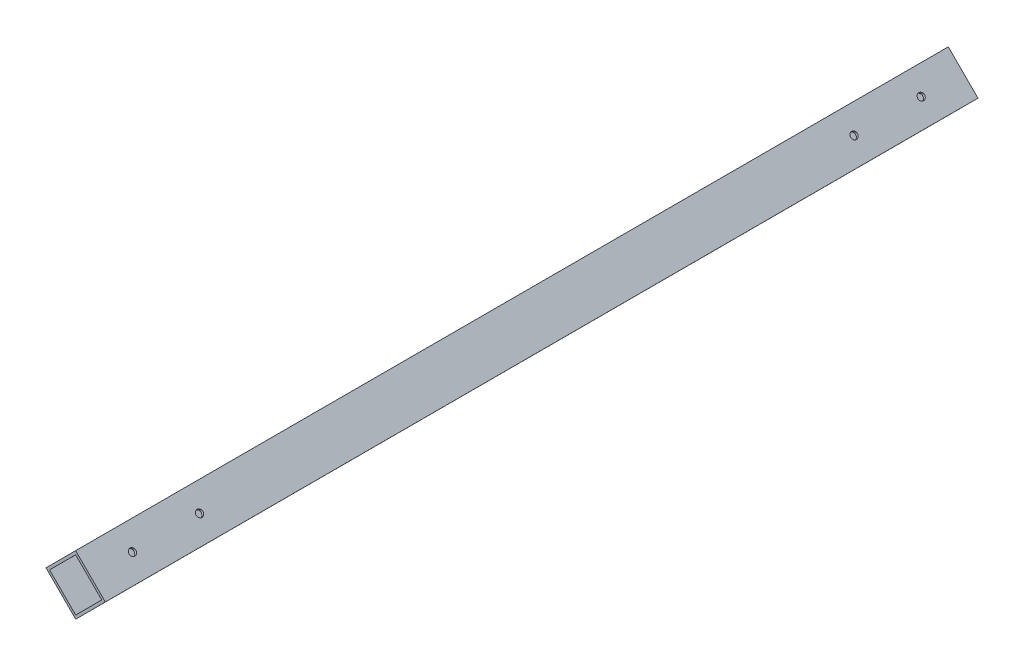
ISO-10303-21;
HEADER;
FILE_DESCRIPTION(('STEP AP214'),'2;1');
FILE_NAME('part.step','',(''),(''),'','','');
FILE_SCHEMA(('AUTOMOTIVE_DESIGN { 1 0 10303 214 1 1 1 1 }'));
ENDSEC;
DATA;
#1=APPLICATION_CONTEXT('core data for automotive mechanical design processes');
#2=APPLICATION_PROTOCOL_DEFINITION('international standard','automotive_design',2000,#1);
#3=PRODUCT_CONTEXT('',#1,'mechanical');
#4=PRODUCT('Part','Part','',(#3));
#5=PRODUCT_RELATED_PRODUCT_CATEGORY('part','',(#4));
#6=PRODUCT_DEFINITION_FORMATION('','',#4);
#7=PRODUCT_DEFINITION_CONTEXT('part definition',#1,'design');
#8=PRODUCT_DEFINITION('design','',#6,#7);
#9=PRODUCT_DEFINITION_SHAPE('','',#8);
#10=(LENGTH_UNIT() NAMED_UNIT(*) SI_UNIT(.MILLI.,.METRE.));
#11=(NAMED_UNIT(*) PLANE_ANGLE_UNIT() SI_UNIT($,.RADIAN.));
#12=(NAMED_UNIT(*) SI_UNIT($,.STERADIAN.) SOLID_ANGLE_UNIT());
#13=UNCERTAINTY_MEASURE_WITH_UNIT(LENGTH_MEASURE(1.E-05),#10,'distance_accuracy_value','');
#14=(GEOMETRIC_REPRESENTATION_CONTEXT(3) GLOBAL_UNCERTAINTY_ASSIGNED_CONTEXT((#13)) GLOBAL_UNIT_ASSIGNED_CONTEXT((#10,
#11,#12)) REPRESENTATION_CONTEXT('',''));
#15=CARTESIAN_POINT('',(0.,0.,0.));
#16=DIRECTION('',(0.,0.,1.));
#17=DIRECTION('',(1.,0.,0.));
#18=AXIS2_PLACEMENT_3D('',#15,#16,#17);
#19=CARTESIAN_POINT('',(0.,0.,520.));
#20=DIRECTION('',(0.,0.,1.));
#21=DIRECTION('',(1.,0.,0.));
#22=AXIS2_PLACEMENT_3D('',#19,#20,#21);
#23=PLANE('',#22);
#24=DIRECTION('',(-0.70646122875546,-0.707751744798503,0.));
#25=VECTOR('',#24,1.);
#26=CARTESIAN_POINT('',(0.,0.,520.));
#27=LINE('',#26,#25);
#28=CARTESIAN_POINT('',(0.,0.,520.));
#29=VERTEX_POINT('',#28);
#30=CARTESIAN_POINT('',(-17.6615307188865,-17.6937936199626,520.));
#31=VERTEX_POINT('',#30);
#32=EDGE_CURVE('E143',#29,#31,#27,.T.);
#33=ORIENTED_EDGE('',*,*,#32,.T.);
#34=DIRECTION('',(0.707751744798503,-0.70646122875546,0.));
#35=VECTOR('',#34,1.);
#36=CARTESIAN_POINT('',(-17.6615307188865,-17.6937936199626,520.));
#37=LINE('',#36,#35);
#38=CARTESIAN_POINT('',(0.0322629010760627,-35.3553243388491,520.));
#39=VERTEX_POINT('',#38);
#40=EDGE_CURVE('E146',#31,#39,#37,.T.);
#41=ORIENTED_EDGE('',*,*,#40,.T.);
#42=DIRECTION('',(0.70646122875546,0.707751744798503,0.));
#43=VECTOR('',#42,1.);
#44=CARTESIAN_POINT('',(17.6937936199626,-17.6615307188865,520.));
#45=LINE('',#44,#43);
#46=CARTESIAN_POINT('',(17.6937936199626,-17.6615307188865,520.));
#47=VERTEX_POINT('',#46);
#48=EDGE_CURVE('E149',#39,#47,#45,.T.);
#49=ORIENTED_EDGE('',*,*,#48,.T.);
#50=DIRECTION('',(-0.707751744798503,0.70646122875546,0.));
#51=VECTOR('',#50,1.);
#52=CARTESIAN_POINT('',(0.,0.,520.));
#53=LINE('',#52,#51);
#54=EDGE_CURVE('E151',#47,#29,#53,.T.);
#55=ORIENTED_EDGE('',*,*,#54,.T.);
#56=EDGE_LOOP('',(#33,#41,#49,#55));
#57=FACE_BOUND('',#56,.T.);
#58=DIRECTION('',(-0.706461228755461,-0.707751744798503,0.));
#59=VECTOR('',#58,1.);
#60=CARTESIAN_POINT('',(0.00193577406456353,-2.12131946033095,520.));
#61=LINE('',#60,#59);
#62=CARTESIAN_POINT('',(0.00193577406456353,-2.12131946033095,520.));
#63=VERTEX_POINT('',#62);
#64=CARTESIAN_POINT('',(-15.5402112585556,-17.691857845898,520.));
#65=VERTEX_POINT('',#64);
#66=EDGE_CURVE('E113',#63,#65,#61,.T.);
#67=ORIENTED_EDGE('',*,*,#66,.F.);
#68=DIRECTION('',(-0.707751744798503,0.70646122875546,0.));
#69=VECTOR('',#68,1.);
#70=CARTESIAN_POINT('',(0.00193577406456353,-2.12131946033095,520.));
#71=LINE('',#70,#69);
#72=CARTESIAN_POINT('',(15.5724741596316,-17.6634664929511,520.));
#73=VERTEX_POINT('',#72);
#74=EDGE_CURVE('E105',#73,#63,#71,.T.);
#75=ORIENTED_EDGE('',*,*,#74,.F.);
#76=DIRECTION('',(0.70646122875546,0.707751744798503,0.));
#77=VECTOR('',#76,1.);
#78=CARTESIAN_POINT('',(15.5724741596316,-17.6634664929511,520.));
#79=LINE('',#78,#77);
#80=CARTESIAN_POINT('',(0.0303271270114952,-33.2340048785181,520.));
#81=VERTEX_POINT('',#80);
#82=EDGE_CURVE('E127',#81,#73,#79,.T.);
#83=ORIENTED_EDGE('',*,*,#82,.F.);
#84=DIRECTION('',(0.707751744798503,-0.70646122875546,0.));
#85=VECTOR('',#84,1.);
#86=CARTESIAN_POINT('',(-15.5402112585556,-17.691857845898,520.));
#87=LINE('',#86,#85);
#88=EDGE_CURVE('E125',#65,#81,#87,.T.);
#89=ORIENTED_EDGE('',*,*,#88,.F.);
#90=EDGE_LOOP('',(#67,#75,#83,#89));
#91=FACE_BOUND('',#90,.T.);
#92=ADVANCED_FACE('F38',(#57,#91),#23,.T.);
#93=CARTESIAN_POINT('',(0.,0.,0.));
#94=DIRECTION('',(0.,0.,1.));
#95=DIRECTION('',(1.,0.,0.));
#96=AXIS2_PLACEMENT_3D('',#93,#94,#95);
#97=PLANE('',#96);
#98=DIRECTION('',(-0.70646122875546,-0.707751744798503,0.));
#99=VECTOR('',#98,1.);
#100=CARTESIAN_POINT('',(0.,0.,0.));
#101=LINE('',#100,#99);
#102=CARTESIAN_POINT('',(0.,0.,0.));
#103=VERTEX_POINT('',#102);
#104=CARTESIAN_POINT('',(-17.6615307188865,-17.6937936199626,0.));
#105=VERTEX_POINT('',#104);
#106=EDGE_CURVE('E121',#103,#105,#101,.T.);
#107=ORIENTED_EDGE('',*,*,#106,.F.);
#108=DIRECTION('',(-0.707751744798503,0.70646122875546,0.));
#109=VECTOR('',#108,1.);
#110=CARTESIAN_POINT('',(0.,0.,0.));
#111=LINE('',#110,#109);
#112=CARTESIAN_POINT('',(17.6937936199626,-17.6615307188865,0.));
#113=VERTEX_POINT('',#112);
#114=EDGE_CURVE('E147',#113,#103,#111,.T.);
#115=ORIENTED_EDGE('',*,*,#114,.F.);
#116=DIRECTION('',(0.70646122875546,0.707751744798503,0.));
#117=VECTOR('',#116,1.);
#118=CARTESIAN_POINT('',(17.6937936199626,-17.6615307188865,0.));
#119=LINE('',#118,#117);
#120=CARTESIAN_POINT('',(0.0322629010760627,-35.3553243388491,0.));
#121=VERTEX_POINT('',#120);
#122=EDGE_CURVE('E158',#121,#113,#119,.T.);
#123=ORIENTED_EDGE('',*,*,#122,.F.);
#124=DIRECTION('',(0.707751744798503,-0.70646122875546,0.));
#125=VECTOR('',#124,1.);
#126=CARTESIAN_POINT('',(-17.6615307188865,-17.6937936199626,0.));
#127=LINE('',#126,#125);
#128=EDGE_CURVE('E156',#105,#121,#127,.T.);
#129=ORIENTED_EDGE('',*,*,#128,.F.);
#130=EDGE_LOOP('',(#107,#115,#123,#129));
#131=FACE_BOUND('',#130,.T.);
#132=DIRECTION('',(-0.707751744798503,0.70646122875546,0.));
#133=VECTOR('',#132,1.);
#134=CARTESIAN_POINT('',(0.00193577406456353,-2.12131946033095,0.));
#135=LINE('',#134,#133);
#136=CARTESIAN_POINT('',(15.5724741596316,-17.6634664929511,0.));
#137=VERTEX_POINT('',#136);
#138=CARTESIAN_POINT('',(0.00193577406456353,-2.12131946033095,0.));
#139=VERTEX_POINT('',#138);
#140=EDGE_CURVE('E63',#137,#139,#135,.T.);
#141=ORIENTED_EDGE('',*,*,#140,.T.);
#142=DIRECTION('',(-0.706461228755461,-0.707751744798503,0.));
#143=VECTOR('',#142,1.);
#144=CARTESIAN_POINT('',(0.00193577406456353,-2.12131946033095,0.));
#145=LINE('',#144,#143);
#146=CARTESIAN_POINT('',(-15.5402112585556,-17.691857845898,0.));
#147=VERTEX_POINT('',#146);
#148=EDGE_CURVE('E120',#139,#147,#145,.T.);
#149=ORIENTED_EDGE('',*,*,#148,.T.);
#150=DIRECTION('',(0.707751744798503,-0.70646122875546,0.));
#151=VECTOR('',#150,1.);
#152=CARTESIAN_POINT('',(-15.5402112585556,-17.691857845898,0.));
#153=LINE('',#152,#151);
#154=CARTESIAN_POINT('',(0.0303271270114987,-33.2340048785181,0.));
#155=VERTEX_POINT('',#154);
#156=EDGE_CURVE('E135',#147,#155,#153,.T.);
#157=ORIENTED_EDGE('',*,*,#156,.T.);
#158=DIRECTION('',(0.70646122875546,0.707751744798503,0.));
#159=VECTOR('',#158,1.);
#160=CARTESIAN_POINT('',(15.5724741596316,-17.6634664929511,0.));
#161=LINE('',#160,#159);
#162=EDGE_CURVE('E114',#155,#137,#161,.T.);
#163=ORIENTED_EDGE('',*,*,#162,.T.);
#164=EDGE_LOOP('',(#141,#149,#157,#163));
#165=FACE_BOUND('',#164,.T.);
#166=ADVANCED_FACE('F227',(#131,#165),#97,.F.);
#167=CARTESIAN_POINT('',(0.,0.,520.));
#168=DIRECTION('',(0.707751744798503,-0.70646122875546,0.));
#169=DIRECTION('',(0.70646122875546,0.707751744798503,0.));
#170=AXIS2_PLACEMENT_3D('',#167,#168,#169);
#171=PLANE('',#170);
#172=ORIENTED_EDGE('',*,*,#106,.T.);
#173=DIRECTION('',(0.,0.,-1.));
#174=VECTOR('',#173,1.);
#175=CARTESIAN_POINT('',(-17.6615307188865,-17.6937936199626,520.));
#176=LINE('',#175,#174);
#177=EDGE_CURVE('E11',#31,#105,#176,.T.);
#178=ORIENTED_EDGE('',*,*,#177,.F.);
#179=ORIENTED_EDGE('',*,*,#32,.F.);
#180=DIRECTION('',(0.,0.,-1.));
#181=VECTOR('',#180,1.);
#182=CARTESIAN_POINT('',(0.,0.,520.));
#183=LINE('',#182,#181);
#184=EDGE_CURVE('E153',#29,#103,#183,.T.);
#185=ORIENTED_EDGE('',*,*,#184,.T.);
#186=EDGE_LOOP('',(#172,#178,#179,#185));
#187=FACE_BOUND('',#186,.T.);
#188=ADVANCED_FACE('F40',(#187),#171,.F.);
#189=CARTESIAN_POINT('',(-17.6615307188865,-17.6937936199626,520.));
#190=DIRECTION('',(0.70646122875546,0.707751744798503,0.));
#191=DIRECTION('',(-0.707751744798503,0.70646122875546,0.));
#192=AXIS2_PLACEMENT_3D('',#189,#190,#191);
#193=PLANE('',#192);
#194=CARTESIAN_POINT('',(-8.81463390890521,-26.5245589794058,495.));
#195=DIRECTION('',(0.70646122875546,0.707751744798503,0.));
#196=DIRECTION('',(-0.707751744798503,0.70646122875546,0.));
#197=AXIS2_PLACEMENT_3D('',#194,#195,#196);
#198=CIRCLE('',#197,2.);
#199=CARTESIAN_POINT('',(-10.2301373985022,-25.1116365218949,495.));
#200=VERTEX_POINT('',#199);
#201=EDGE_CURVE('E133',#200,#200,#198,.T.);
#202=ORIENTED_EDGE('',*,*,#201,.T.);
#203=EDGE_LOOP('',(#202));
#204=FACE_BOUND('',#203,.T.);
#205=CARTESIAN_POINT('',(-8.81463390890523,-26.5245589794058,25.));
#206=DIRECTION('',(0.70646122875546,0.707751744798503,0.));
#207=DIRECTION('',(-0.707751744798503,0.70646122875546,0.));
#208=AXIS2_PLACEMENT_3D('',#205,#206,#207);
#209=CIRCLE('',#208,2.);
#210=CARTESIAN_POINT('',(-10.2301373985022,-25.1116365218949,25.));
#211=VERTEX_POINT('',#210);
#212=EDGE_CURVE('E184',#211,#211,#209,.T.);
#213=ORIENTED_EDGE('',*,*,#212,.T.);
#214=EDGE_LOOP('',(#213));
#215=FACE_BOUND('',#214,.T.);
#216=CARTESIAN_POINT('',(-8.81463390890523,-26.5245589794058,65.));
#217=DIRECTION('',(0.70646122875546,0.707751744798503,0.));
#218=DIRECTION('',(-0.707751744798503,0.70646122875546,0.));
#219=AXIS2_PLACEMENT_3D('',#216,#217,#218);
#220=CIRCLE('',#219,2.);
#221=CARTESIAN_POINT('',(-10.2301373985022,-25.1116365218949,65.));
#222=VERTEX_POINT('',#221);
#223=EDGE_CURVE('E180',#222,#222,#220,.T.);
#224=ORIENTED_EDGE('',*,*,#223,.T.);
#225=EDGE_LOOP('',(#224));
#226=FACE_BOUND('',#225,.T.);
#227=CARTESIAN_POINT('',(-8.81463390890521,-26.5245589794058,455.));
#228=DIRECTION('',(0.70646122875546,0.707751744798503,0.));
#229=DIRECTION('',(-0.707751744798503,0.70646122875546,0.));
#230=AXIS2_PLACEMENT_3D('',#227,#228,#229);
#231=CIRCLE('',#230,2.);
#232=CARTESIAN_POINT('',(-10.2301373985022,-25.1116365218949,455.));
#233=VERTEX_POINT('',#232);
#234=EDGE_CURVE('E176',#233,#233,#231,.T.);
#235=ORIENTED_EDGE('',*,*,#234,.T.);
#236=EDGE_LOOP('',(#235));
#237=FACE_BOUND('',#236,.T.);
#238=ORIENTED_EDGE('',*,*,#128,.T.);
#239=DIRECTION('',(0.,0.,-1.));
#240=VECTOR('',#239,1.);
#241=CARTESIAN_POINT('',(0.0322629010760627,-35.3553243388491,520.));
#242=LINE('',#241,#240);
#243=EDGE_CURVE('E47',#39,#121,#242,.T.);
#244=ORIENTED_EDGE('',*,*,#243,.F.);
#245=ORIENTED_EDGE('',*,*,#40,.F.);
#246=ORIENTED_EDGE('',*,*,#177,.T.);
#247=EDGE_LOOP('',(#238,#244,#245,#246));
#248=FACE_BOUND('',#247,.T.);
#249=ADVANCED_FACE('F201',(#204,#215,#226,#237,#248),#193,.F.);
#250=CARTESIAN_POINT('',(17.6937936199626,-17.6615307188865,520.));
#251=DIRECTION('',(-0.707751744798503,0.70646122875546,0.));
#252=DIRECTION('',(-0.70646122875546,-0.707751744798503,0.));
#253=AXIS2_PLACEMENT_3D('',#250,#251,#252);
#254=PLANE('',#253);
#255=ORIENTED_EDGE('',*,*,#122,.T.);
#256=DIRECTION('',(0.,0.,-1.));
#257=VECTOR('',#256,1.);
#258=CARTESIAN_POINT('',(17.6937936199626,-17.6615307188865,520.));
#259=LINE('',#258,#257);
#260=EDGE_CURVE('E163',#47,#113,#259,.T.);
#261=ORIENTED_EDGE('',*,*,#260,.F.);
#262=ORIENTED_EDGE('',*,*,#48,.F.);
#263=ORIENTED_EDGE('',*,*,#243,.T.);
#264=EDGE_LOOP('',(#255,#261,#262,#263));
#265=FACE_BOUND('',#264,.T.);
#266=ADVANCED_FACE('F241',(#265),#254,.F.);
#267=CARTESIAN_POINT('',(0.,0.,520.));
#268=DIRECTION('',(-0.70646122875546,-0.707751744798503,0.));
#269=DIRECTION('',(0.707751744798503,-0.70646122875546,0.));
#270=AXIS2_PLACEMENT_3D('',#267,#268,#269);
#271=PLANE('',#270);
#272=CARTESIAN_POINT('',(8.8468968099813,-8.83076535944327,495.));
#273=DIRECTION('',(0.706461228755461,0.707751744798503,0.));
#274=DIRECTION('',(-0.707751744798503,0.706461228755461,0.));
#275=AXIS2_PLACEMENT_3D('',#272,#273,#274);
#276=CIRCLE('',#275,2.);
#277=CARTESIAN_POINT('',(7.43139332038429,-7.41784290193235,495.));
#278=VERTEX_POINT('',#277);
#279=EDGE_CURVE('E297',#278,#278,#276,.T.);
#280=ORIENTED_EDGE('',*,*,#279,.F.);
#281=EDGE_LOOP('',(#280));
#282=FACE_BOUND('',#281,.T.);
#283=CARTESIAN_POINT('',(8.84689680998128,-8.83076535944326,25.));
#284=DIRECTION('',(0.706461228755461,0.707751744798503,0.));
#285=DIRECTION('',(-0.707751744798503,0.706461228755461,0.));
#286=AXIS2_PLACEMENT_3D('',#283,#284,#285);
#287=CIRCLE('',#286,2.);
#288=CARTESIAN_POINT('',(7.43139332038428,-7.41784290193234,25.));
#289=VERTEX_POINT('',#288);
#290=EDGE_CURVE('E298',#289,#289,#287,.T.);
#291=ORIENTED_EDGE('',*,*,#290,.F.);
#292=EDGE_LOOP('',(#291));
#293=FACE_BOUND('',#292,.T.);
#294=CARTESIAN_POINT('',(8.84689680998128,-8.83076535944326,65.));
#295=DIRECTION('',(0.706461228755461,0.707751744798503,0.));
#296=DIRECTION('',(-0.707751744798503,0.706461228755461,0.));
#297=AXIS2_PLACEMENT_3D('',#294,#295,#296);
#298=CIRCLE('',#297,2.);
#299=CARTESIAN_POINT('',(7.43139332038428,-7.41784290193234,65.));
#300=VERTEX_POINT('',#299);
#301=EDGE_CURVE('E301',#300,#300,#298,.T.);
#302=ORIENTED_EDGE('',*,*,#301,.F.);
#303=EDGE_LOOP('',(#302));
#304=FACE_BOUND('',#303,.T.);
#305=CARTESIAN_POINT('',(8.8468968099813,-8.83076535944327,455.));
#306=DIRECTION('',(0.706461228755461,0.707751744798503,0.));
#307=DIRECTION('',(-0.707751744798503,0.706461228755461,0.));
#308=AXIS2_PLACEMENT_3D('',#305,#306,#307);
#309=CIRCLE('',#308,2.);
#310=CARTESIAN_POINT('',(7.43139332038429,-7.41784290193235,455.));
#311=VERTEX_POINT('',#310);
#312=EDGE_CURVE('E172',#311,#311,#309,.T.);
#313=ORIENTED_EDGE('',*,*,#312,.F.);
#314=EDGE_LOOP('',(#313));
#315=FACE_BOUND('',#314,.T.);
#316=ORIENTED_EDGE('',*,*,#114,.T.);
#317=ORIENTED_EDGE('',*,*,#184,.F.);
#318=ORIENTED_EDGE('',*,*,#54,.F.);
#319=ORIENTED_EDGE('',*,*,#260,.T.);
#320=EDGE_LOOP('',(#316,#317,#318,#319));
#321=FACE_BOUND('',#320,.T.);
#322=ADVANCED_FACE('F238',(#282,#293,#304,#315,#321),#271,.F.);
#323=CARTESIAN_POINT('',(0.00193577406456353,-2.12131946033095,520.));
#324=DIRECTION('',(-0.70646122875546,-0.707751744798503,0.));
#325=DIRECTION('',(0.707751744798503,-0.70646122875546,0.));
#326=AXIS2_PLACEMENT_3D('',#323,#324,#325);
#327=PLANE('',#326);
#328=CARTESIAN_POINT('',(7.78720496684811,-9.89239297664102,495.));
#329=DIRECTION('',(-0.70646122875546,-0.707751744798503,0.));
#330=DIRECTION('',(0.707751744798503,-0.70646122875546,0.));
#331=AXIS2_PLACEMENT_3D('',#328,#329,#330);
#332=CIRCLE('',#331,2.);
#333=CARTESIAN_POINT('',(9.20270845644512,-11.3053154341519,495.));
#334=VERTEX_POINT('',#333);
#335=EDGE_CURVE('E196',#334,#334,#332,.T.);
#336=ORIENTED_EDGE('',*,*,#335,.F.);
#337=EDGE_LOOP('',(#336));
#338=FACE_BOUND('',#337,.T.);
#339=CARTESIAN_POINT('',(7.78720496684809,-9.89239297664101,25.));
#340=DIRECTION('',(-0.70646122875546,-0.707751744798503,0.));
#341=DIRECTION('',(0.707751744798503,-0.70646122875546,0.));
#342=AXIS2_PLACEMENT_3D('',#339,#340,#341);
#343=CIRCLE('',#342,2.);
#344=CARTESIAN_POINT('',(9.2027084564451,-11.3053154341519,25.));
#345=VERTEX_POINT('',#344);
#346=EDGE_CURVE('E179',#345,#345,#343,.T.);
#347=ORIENTED_EDGE('',*,*,#346,.F.);
#348=EDGE_LOOP('',(#347));
#349=FACE_BOUND('',#348,.T.);
#350=CARTESIAN_POINT('',(7.78720496684809,-9.89239297664101,65.));
#351=DIRECTION('',(-0.70646122875546,-0.707751744798503,0.));
#352=DIRECTION('',(0.707751744798503,-0.70646122875546,0.));
#353=AXIS2_PLACEMENT_3D('',#350,#351,#352);
#354=CIRCLE('',#353,2.);
#355=CARTESIAN_POINT('',(9.2027084564451,-11.3053154341519,65.));
#356=VERTEX_POINT('',#355);
#357=EDGE_CURVE('E175',#356,#356,#354,.T.);
#358=ORIENTED_EDGE('',*,*,#357,.F.);
#359=EDGE_LOOP('',(#358));
#360=FACE_BOUND('',#359,.T.);
#361=CARTESIAN_POINT('',(7.78720496684811,-9.89239297664102,455.));
#362=DIRECTION('',(-0.70646122875546,-0.707751744798503,0.));
#363=DIRECTION('',(0.707751744798503,-0.70646122875546,0.));
#364=AXIS2_PLACEMENT_3D('',#361,#362,#363);
#365=CIRCLE('',#364,2.);
#366=CARTESIAN_POINT('',(9.20270845644512,-11.3053154341519,455.));
#367=VERTEX_POINT('',#366);
#368=EDGE_CURVE('E171',#367,#367,#365,.T.);
#369=ORIENTED_EDGE('',*,*,#368,.F.);
#370=EDGE_LOOP('',(#369));
#371=FACE_BOUND('',#370,.T.);
#372=ORIENTED_EDGE('',*,*,#140,.F.);
#373=DIRECTION('',(0.,0.,-1.));
#374=VECTOR('',#373,1.);
#375=CARTESIAN_POINT('',(15.5724741596316,-17.6634664929511,520.));
#376=LINE('',#375,#374);
#377=EDGE_CURVE('E109',#73,#137,#376,.T.);
#378=ORIENTED_EDGE('',*,*,#377,.F.);
#379=ORIENTED_EDGE('',*,*,#74,.T.);
#380=DIRECTION('',(0.,0.,-1.));
#381=VECTOR('',#380,1.);
#382=CARTESIAN_POINT('',(0.00193577406456353,-2.12131946033095,520.));
#383=LINE('',#382,#381);
#384=EDGE_CURVE('E108',#63,#139,#383,.T.);
#385=ORIENTED_EDGE('',*,*,#384,.T.);
#386=EDGE_LOOP('',(#372,#378,#379,#385));
#387=FACE_BOUND('',#386,.T.);
#388=ADVANCED_FACE('F107',(#338,#349,#360,#371,#387),#327,.T.);
#389=CARTESIAN_POINT('',(0.00193577406456353,-2.12131946033095,520.));
#390=DIRECTION('',(0.707751744798503,-0.706461228755461,0.));
#391=DIRECTION('',(0.706461228755461,0.707751744798503,0.));
#392=AXIS2_PLACEMENT_3D('',#389,#390,#391);
#393=PLANE('',#392);
#394=ORIENTED_EDGE('',*,*,#148,.F.);
#395=ORIENTED_EDGE('',*,*,#384,.F.);
#396=ORIENTED_EDGE('',*,*,#66,.T.);
#397=DIRECTION('',(0.,0.,-1.));
#398=VECTOR('',#397,1.);
#399=CARTESIAN_POINT('',(-15.5402112585556,-17.691857845898,520.));
#400=LINE('',#399,#398);
#401=EDGE_CURVE('E122',#65,#147,#400,.T.);
#402=ORIENTED_EDGE('',*,*,#401,.T.);
#403=EDGE_LOOP('',(#394,#395,#396,#402));
#404=FACE_BOUND('',#403,.T.);
#405=ADVANCED_FACE('F117',(#404),#393,.T.);
#406=CARTESIAN_POINT('',(-15.5402112585556,-17.691857845898,520.));
#407=DIRECTION('',(0.70646122875546,0.707751744798503,0.));
#408=DIRECTION('',(-0.707751744798503,0.70646122875546,0.));
#409=AXIS2_PLACEMENT_3D('',#406,#407,#408);
#410=PLANE('',#409);
#411=CARTESIAN_POINT('',(-7.75494206577203,-25.4629313622081,495.));
#412=DIRECTION('',(0.70646122875546,0.707751744798503,0.));
#413=DIRECTION('',(-0.707751744798503,0.70646122875546,0.));
#414=AXIS2_PLACEMENT_3D('',#411,#412,#413);
#415=CIRCLE('',#414,2.);
#416=CARTESIAN_POINT('',(-9.17044555536904,-24.0500089046972,495.));
#417=VERTEX_POINT('',#416);
#418=EDGE_CURVE('E42',#417,#417,#415,.T.);
#419=ORIENTED_EDGE('',*,*,#418,.F.);
#420=EDGE_LOOP('',(#419));
#421=FACE_BOUND('',#420,.T.);
#422=CARTESIAN_POINT('',(-7.75494206577204,-25.4629313622081,25.));
#423=DIRECTION('',(0.70646122875546,0.707751744798503,0.));
#424=DIRECTION('',(-0.707751744798503,0.70646122875546,0.));
#425=AXIS2_PLACEMENT_3D('',#422,#423,#424);
#426=CIRCLE('',#425,2.);
#427=CARTESIAN_POINT('',(-9.17044555536905,-24.0500089046971,25.));
#428=VERTEX_POINT('',#427);
#429=EDGE_CURVE('E177',#428,#428,#426,.T.);
#430=ORIENTED_EDGE('',*,*,#429,.F.);
#431=EDGE_LOOP('',(#430));
#432=FACE_BOUND('',#431,.T.);
#433=CARTESIAN_POINT('',(-7.75494206577204,-25.4629313622081,65.));
#434=DIRECTION('',(0.70646122875546,0.707751744798503,0.));
#435=DIRECTION('',(-0.707751744798503,0.70646122875546,0.));
#436=AXIS2_PLACEMENT_3D('',#433,#434,#435);
#437=CIRCLE('',#436,2.);
#438=CARTESIAN_POINT('',(-9.17044555536905,-24.0500089046971,65.));
#439=VERTEX_POINT('',#438);
#440=EDGE_CURVE('E173',#439,#439,#437,.T.);
#441=ORIENTED_EDGE('',*,*,#440,.F.);
#442=EDGE_LOOP('',(#441));
#443=FACE_BOUND('',#442,.T.);
#444=CARTESIAN_POINT('',(-7.75494206577203,-25.4629313622081,455.));
#445=DIRECTION('',(0.70646122875546,0.707751744798503,0.));
#446=DIRECTION('',(-0.707751744798503,0.70646122875546,0.));
#447=AXIS2_PLACEMENT_3D('',#444,#445,#446);
#448=CIRCLE('',#447,2.);
#449=CARTESIAN_POINT('',(-9.17044555536904,-24.0500089046972,455.));
#450=VERTEX_POINT('',#449);
#451=EDGE_CURVE('E168',#450,#450,#448,.T.);
#452=ORIENTED_EDGE('',*,*,#451,.F.);
#453=EDGE_LOOP('',(#452));
#454=FACE_BOUND('',#453,.T.);
#455=ORIENTED_EDGE('',*,*,#156,.F.);
#456=ORIENTED_EDGE('',*,*,#401,.F.);
#457=ORIENTED_EDGE('',*,*,#88,.T.);
#458=DIRECTION('',(0.,0.,-1.));
#459=VECTOR('',#458,1.);
#460=CARTESIAN_POINT('',(0.0303271270114987,-33.2340048785181,520.));
#461=LINE('',#460,#459);
#462=EDGE_CURVE('E55',#81,#155,#461,.T.);
#463=ORIENTED_EDGE('',*,*,#462,.T.);
#464=EDGE_LOOP('',(#455,#456,#457,#463));
#465=FACE_BOUND('',#464,.T.);
#466=ADVANCED_FACE('F268',(#421,#432,#443,#454,#465),#410,.T.);
#467=CARTESIAN_POINT('',(15.5724741596316,-17.6634664929511,520.));
#468=DIRECTION('',(-0.707751744798503,0.70646122875546,0.));
#469=DIRECTION('',(-0.70646122875546,-0.707751744798503,0.));
#470=AXIS2_PLACEMENT_3D('',#467,#468,#469);
#471=PLANE('',#470);
#472=ORIENTED_EDGE('',*,*,#162,.F.);
#473=ORIENTED_EDGE('',*,*,#462,.F.);
#474=ORIENTED_EDGE('',*,*,#82,.T.);
#475=ORIENTED_EDGE('',*,*,#377,.T.);
#476=EDGE_LOOP('',(#472,#473,#474,#475));
#477=FACE_BOUND('',#476,.T.);
#478=ADVANCED_FACE('F266',(#477),#471,.T.);
#479=CARTESIAN_POINT('',(-17.6453845613123,-35.3714410554851,455.));
#480=DIRECTION('',(0.706461228755461,0.707751744798503,0.));
#481=DIRECTION('',(-0.707751744798503,0.706461228755461,0.));
#482=AXIS2_PLACEMENT_3D('',#479,#480,#481);
#483=CYLINDRICAL_SURFACE('',#482,2.);
#484=ORIENTED_EDGE('',*,*,#451,.T.);
#485=EDGE_LOOP('',(#484));
#486=FACE_BOUND('',#485,.T.);
#487=ORIENTED_EDGE('',*,*,#234,.F.);
#488=EDGE_LOOP('',(#487));
#489=FACE_BOUND('',#488,.T.);
#490=ADVANCED_FACE('F218',(#486,#489),#483,.F.);
#491=CARTESIAN_POINT('',(-17.6453845613123,-35.3714410554851,65.));
#492=DIRECTION('',(0.706461228755461,0.707751744798503,0.));
#493=DIRECTION('',(-0.707751744798503,0.706461228755461,0.));
#494=AXIS2_PLACEMENT_3D('',#491,#492,#493);
#495=CYLINDRICAL_SURFACE('',#494,2.);
#496=ORIENTED_EDGE('',*,*,#440,.T.);
#497=EDGE_LOOP('',(#496));
#498=FACE_BOUND('',#497,.T.);
#499=ORIENTED_EDGE('',*,*,#223,.F.);
#500=EDGE_LOOP('',(#499));
#501=FACE_BOUND('',#500,.T.);
#502=ADVANCED_FACE('F219',(#498,#501),#495,.F.);
#503=CARTESIAN_POINT('',(-17.6453845613123,-35.3714410554851,25.));
#504=DIRECTION('',(0.706461228755461,0.707751744798503,0.));
#505=DIRECTION('',(-0.707751744798503,0.706461228755461,0.));
#506=AXIS2_PLACEMENT_3D('',#503,#504,#505);
#507=CYLINDRICAL_SURFACE('',#506,2.);
#508=ORIENTED_EDGE('',*,*,#429,.T.);
#509=EDGE_LOOP('',(#508));
#510=FACE_BOUND('',#509,.T.);
#511=ORIENTED_EDGE('',*,*,#212,.F.);
#512=EDGE_LOOP('',(#511));
#513=FACE_BOUND('',#512,.T.);
#514=ADVANCED_FACE('F207',(#510,#513),#507,.F.);
#515=CARTESIAN_POINT('',(-17.6453845613123,-35.3714410554851,495.));
#516=DIRECTION('',(0.706461228755461,0.707751744798503,0.));
#517=DIRECTION('',(-0.707751744798503,0.706461228755461,0.));
#518=AXIS2_PLACEMENT_3D('',#515,#516,#517);
#519=CYLINDRICAL_SURFACE('',#518,2.);
#520=ORIENTED_EDGE('',*,*,#418,.T.);
#521=EDGE_LOOP('',(#520));
#522=FACE_BOUND('',#521,.T.);
#523=ORIENTED_EDGE('',*,*,#201,.F.);
#524=EDGE_LOOP('',(#523));
#525=FACE_BOUND('',#524,.T.);
#526=ADVANCED_FACE('F204',(#522,#525),#519,.F.);
#527=ORIENTED_EDGE('',*,*,#368,.T.);
#528=EDGE_LOOP('',(#527));
#529=FACE_BOUND('',#528,.T.);
#530=ORIENTED_EDGE('',*,*,#312,.T.);
#531=EDGE_LOOP('',(#530));
#532=FACE_BOUND('',#531,.T.);
#533=ADVANCED_FACE('F206',(#529,#532),#483,.F.);
#534=ORIENTED_EDGE('',*,*,#357,.T.);
#535=EDGE_LOOP('',(#534));
#536=FACE_BOUND('',#535,.T.);
#537=ORIENTED_EDGE('',*,*,#301,.T.);
#538=EDGE_LOOP('',(#537));
#539=FACE_BOUND('',#538,.T.);
#540=ADVANCED_FACE('F215',(#536,#539),#495,.F.);
#541=ORIENTED_EDGE('',*,*,#346,.T.);
#542=EDGE_LOOP('',(#541));
#543=FACE_BOUND('',#542,.T.);
#544=ORIENTED_EDGE('',*,*,#290,.T.);
#545=EDGE_LOOP('',(#544));
#546=FACE_BOUND('',#545,.T.);
#547=ADVANCED_FACE('F221',(#543,#546),#507,.F.);
#548=ORIENTED_EDGE('',*,*,#335,.T.);
#549=EDGE_LOOP('',(#548));
#550=FACE_BOUND('',#549,.T.);
#551=ORIENTED_EDGE('',*,*,#279,.T.);
#552=EDGE_LOOP('',(#551));
#553=FACE_BOUND('',#552,.T.);
#554=ADVANCED_FACE('F210',(#550,#553),#519,.F.);
#555=CLOSED_SHELL('',(#92,#166,#188,#249,#266,#322,#388,#405,#466,#478,#490,#502,#514,#526,#533,
#540,#547,#554));
#556=MANIFOLD_SOLID_BREP('B2',#555);
#557=ADVANCED_BREP_SHAPE_REPRESENTATION('',(#18,#556),#14);
#558=SHAPE_DEFINITION_REPRESENTATION(#9,#557);
ENDSEC;
END-ISO-10303-21;
